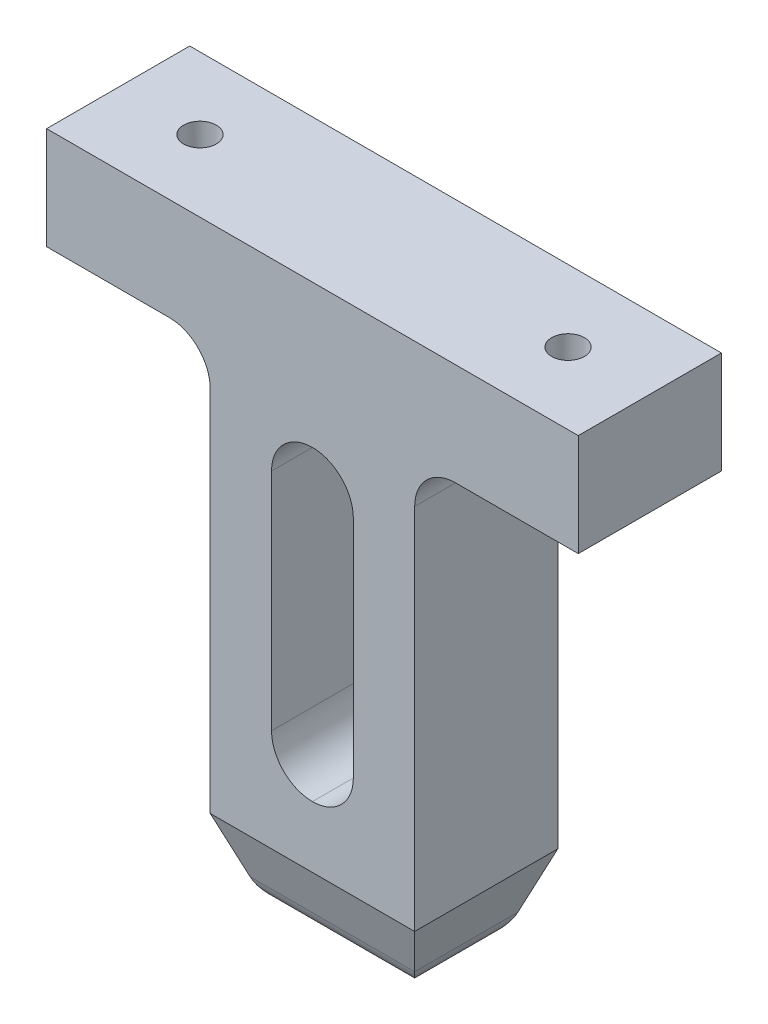
ISO-10303-21;
HEADER;
FILE_DESCRIPTION(('STEP AP214'),'2;1');
FILE_NAME('part.step','',(''),(''),'','','');
FILE_SCHEMA(('AUTOMOTIVE_DESIGN { 1 0 10303 214 1 1 1 1 }'));
ENDSEC;
DATA;
#1=APPLICATION_CONTEXT('core data for automotive mechanical design processes');
#2=APPLICATION_PROTOCOL_DEFINITION('international standard','automotive_design',2000,#1);
#3=PRODUCT_CONTEXT('',#1,'mechanical');
#4=PRODUCT('Part','Part','',(#3));
#5=PRODUCT_RELATED_PRODUCT_CATEGORY('part','',(#4));
#6=PRODUCT_DEFINITION_FORMATION('','',#4);
#7=PRODUCT_DEFINITION_CONTEXT('part definition',#1,'design');
#8=PRODUCT_DEFINITION('design','',#6,#7);
#9=PRODUCT_DEFINITION_SHAPE('','',#8);
#10=(LENGTH_UNIT() NAMED_UNIT(*) SI_UNIT(.MILLI.,.METRE.));
#11=(NAMED_UNIT(*) PLANE_ANGLE_UNIT() SI_UNIT($,.RADIAN.));
#12=(NAMED_UNIT(*) SI_UNIT($,.STERADIAN.) SOLID_ANGLE_UNIT());
#13=UNCERTAINTY_MEASURE_WITH_UNIT(LENGTH_MEASURE(1.E-05),#10,'distance_accuracy_value','');
#14=(GEOMETRIC_REPRESENTATION_CONTEXT(3) GLOBAL_UNCERTAINTY_ASSIGNED_CONTEXT((#13)) GLOBAL_UNIT_ASSIGNED_CONTEXT((#10,
#11,#12)) REPRESENTATION_CONTEXT('',''));
#15=CARTESIAN_POINT('',(0.,0.,0.));
#16=DIRECTION('',(0.,0.,1.));
#17=DIRECTION('',(1.,0.,0.));
#18=AXIS2_PLACEMENT_3D('',#15,#16,#17);
#19=CARTESIAN_POINT('',(18.,-22.5,3.5));
#20=DIRECTION('',(0.939692620785908,-0.342020143325669,0.));
#21=DIRECTION('',(0.342020143325669,0.939692620785908,0.));
#22=AXIS2_PLACEMENT_3D('',#19,#20,#21);
#23=PLANE('',#22);
#24=DIRECTION('',(0.323615577118185,0.889126490715988,0.323615577118185));
#25=VECTOR('',#24,1.);
#26=CARTESIAN_POINT('',(18.,-22.5,3.5));
#27=LINE('',#26,#25);
#28=CARTESIAN_POINT('',(17.0230892280876,-25.1840402866513,2.52308922808758));
#29=VERTEX_POINT('',#28);
#30=CARTESIAN_POINT('',(18.,-22.5,3.5));
#31=VERTEX_POINT('',#30);
#32=EDGE_CURVE('E101',#29,#31,#27,.T.);
#33=ORIENTED_EDGE('',*,*,#32,.F.);
#34=DIRECTION('',(0.,0.,1.));
#35=VECTOR('',#34,1.);
#36=CARTESIAN_POINT('',(17.0230892280876,-25.1840402866513,3.5));
#37=LINE('',#36,#35);
#38=CARTESIAN_POINT('',(17.0230892280876,-25.1840402866513,-2.52308922808759));
#39=VERTEX_POINT('',#38);
#40=EDGE_CURVE('E12',#29,#39,#37,.F.);
#41=ORIENTED_EDGE('',*,*,#40,.T.);
#42=DIRECTION('',(0.323615577118185,0.889126490715988,-0.323615577118185));
#43=VECTOR('',#42,1.);
#44=CARTESIAN_POINT('',(17.2669107077253,-24.5141462769689,-2.76691070772525));
#45=LINE('',#44,#43);
#46=CARTESIAN_POINT('',(18.,-22.5,-3.5));
#47=VERTEX_POINT('',#46);
#48=EDGE_CURVE('E121',#39,#47,#45,.T.);
#49=ORIENTED_EDGE('',*,*,#48,.T.);
#50=DIRECTION('',(0.,0.,1.));
#51=VECTOR('',#50,1.);
#52=CARTESIAN_POINT('',(18.,-22.5,3.5));
#53=LINE('',#52,#51);
#54=EDGE_CURVE('E116',#47,#31,#53,.T.);
#55=ORIENTED_EDGE('',*,*,#54,.T.);
#56=EDGE_LOOP('',(#33,#41,#49,#55));
#57=FACE_BOUND('',#56,.T.);
#58=ADVANCED_FACE('F49',(#57),#23,.T.);
#59=CARTESIAN_POINT('',(18.,-22.5,3.5));
#60=DIRECTION('',(0.,-0.342020143325669,0.939692620785908));
#61=DIRECTION('',(0.,-0.939692620785908,-0.342020143325669));
#62=AXIS2_PLACEMENT_3D('',#59,#60,#61);
#63=PLANE('',#62);
#64=DIRECTION('',(-0.323615577118185,0.889126490715988,0.323615577118185));
#65=VECTOR('',#64,1.);
#66=CARTESIAN_POINT('',(8.,-22.5,3.5));
#67=LINE('',#66,#65);
#68=CARTESIAN_POINT('',(8.97691077191242,-25.1840402866513,2.52308922808758));
#69=VERTEX_POINT('',#68);
#70=CARTESIAN_POINT('',(8.,-22.5,3.5));
#71=VERTEX_POINT('',#70);
#72=EDGE_CURVE('E110',#69,#71,#67,.T.);
#73=ORIENTED_EDGE('',*,*,#72,.F.);
#74=DIRECTION('',(-1.,0.,0.));
#75=VECTOR('',#74,1.);
#76=CARTESIAN_POINT('',(18.,-25.1840402866513,2.52308922808758));
#77=LINE('',#76,#75);
#78=EDGE_CURVE('E58',#69,#29,#77,.F.);
#79=ORIENTED_EDGE('',*,*,#78,.T.);
#80=ORIENTED_EDGE('',*,*,#32,.T.);
#81=DIRECTION('',(-1.,0.,0.));
#82=VECTOR('',#81,1.);
#83=CARTESIAN_POINT('',(18.,-22.5,3.5));
#84=LINE('',#83,#82);
#85=EDGE_CURVE('E104',#31,#71,#84,.T.);
#86=ORIENTED_EDGE('',*,*,#85,.T.);
#87=EDGE_LOOP('',(#73,#79,#80,#86));
#88=FACE_BOUND('',#87,.T.);
#89=ADVANCED_FACE('F103',(#88),#63,.T.);
#90=CARTESIAN_POINT('',(8.,-22.5,3.5));
#91=DIRECTION('',(-0.939692620785908,-0.342020143325669,0.));
#92=DIRECTION('',(0.342020143325669,-0.939692620785908,0.));
#93=AXIS2_PLACEMENT_3D('',#90,#91,#92);
#94=PLANE('',#93);
#95=DIRECTION('',(-0.323615577118185,0.889126490715988,-0.323615577118185));
#96=VECTOR('',#95,1.);
#97=CARTESIAN_POINT('',(9.04727041753537,-25.3773518242412,-2.45272958246464));
#98=LINE('',#97,#96);
#99=CARTESIAN_POINT('',(8.97691077191242,-25.1840402866513,-2.52308922808759));
#100=VERTEX_POINT('',#99);
#101=CARTESIAN_POINT('',(8.,-22.5,-3.5));
#102=VERTEX_POINT('',#101);
#103=EDGE_CURVE('E131',#100,#102,#98,.T.);
#104=ORIENTED_EDGE('',*,*,#103,.F.);
#105=DIRECTION('',(0.,0.,-1.));
#106=VECTOR('',#105,1.);
#107=CARTESIAN_POINT('',(8.97691077191242,-25.1840402866513,3.5));
#108=LINE('',#107,#106);
#109=EDGE_CURVE('E73',#100,#69,#108,.F.);
#110=ORIENTED_EDGE('',*,*,#109,.T.);
#111=ORIENTED_EDGE('',*,*,#72,.T.);
#112=DIRECTION('',(0.,0.,-1.));
#113=VECTOR('',#112,1.);
#114=CARTESIAN_POINT('',(8.,-22.5,3.5));
#115=LINE('',#114,#113);
#116=EDGE_CURVE('E118',#71,#102,#115,.T.);
#117=ORIENTED_EDGE('',*,*,#116,.T.);
#118=EDGE_LOOP('',(#104,#110,#111,#117));
#119=FACE_BOUND('',#118,.T.);
#120=ADVANCED_FACE('F169',(#119),#94,.T.);
#121=CARTESIAN_POINT('',(18.,-22.5,-3.5));
#122=DIRECTION('',(0.,-0.342020143325669,-0.939692620785908));
#123=DIRECTION('',(0.,0.939692620785908,-0.342020143325669));
#124=AXIS2_PLACEMENT_3D('',#121,#122,#123);
#125=PLANE('',#124);
#126=ORIENTED_EDGE('',*,*,#48,.F.);
#127=DIRECTION('',(1.,0.,0.));
#128=VECTOR('',#127,1.);
#129=CARTESIAN_POINT('',(18.,-25.1840402866513,-2.52308922808759));
#130=LINE('',#129,#128);
#131=EDGE_CURVE('E142',#39,#100,#130,.F.);
#132=ORIENTED_EDGE('',*,*,#131,.T.);
#133=ORIENTED_EDGE('',*,*,#103,.T.);
#134=DIRECTION('',(1.,0.,0.));
#135=VECTOR('',#134,1.);
#136=CARTESIAN_POINT('',(18.,-22.5,-3.5));
#137=LINE('',#136,#135);
#138=EDGE_CURVE('E128',#102,#47,#137,.T.);
#139=ORIENTED_EDGE('',*,*,#138,.T.);
#140=EDGE_LOOP('',(#126,#132,#133,#139));
#141=FACE_BOUND('',#140,.T.);
#142=ADVANCED_FACE('F168',(#141),#125,.T.);
#143=CARTESIAN_POINT('',(0.,-26.5,0.));
#144=DIRECTION('',(0.,1.,0.));
#145=DIRECTION('',(0.,0.,1.));
#146=AXIS2_PLACEMENT_3D('',#143,#144,#145);
#147=PLANE('',#146);
#148=DIRECTION('',(0.,0.,1.));
#149=VECTOR('',#148,1.);
#150=CARTESIAN_POINT('',(10.8562960134842,-26.5,0.));
#151=LINE('',#150,#149);
#152=CARTESIAN_POINT('',(10.8562960134842,-26.5,0.643703986515769));
#153=VERTEX_POINT('',#152);
#154=CARTESIAN_POINT('',(10.8562960134842,-26.5,-0.643703986515769));
#155=VERTEX_POINT('',#154);
#156=EDGE_CURVE('E137',#153,#155,#151,.F.);
#157=ORIENTED_EDGE('',*,*,#156,.T.);
#158=DIRECTION('',(-1.,0.,0.));
#159=VECTOR('',#158,1.);
#160=CARTESIAN_POINT('',(0.,-26.5,-0.643703986515769));
#161=LINE('',#160,#159);
#162=CARTESIAN_POINT('',(15.1437039865158,-26.5,-0.643703986515769));
#163=VERTEX_POINT('',#162);
#164=EDGE_CURVE('E139',#155,#163,#161,.F.);
#165=ORIENTED_EDGE('',*,*,#164,.T.);
#166=DIRECTION('',(0.,0.,-1.));
#167=VECTOR('',#166,1.);
#168=CARTESIAN_POINT('',(15.1437039865158,-26.5,0.));
#169=LINE('',#168,#167);
#170=CARTESIAN_POINT('',(15.1437039865158,-26.5,0.643703986515769));
#171=VERTEX_POINT('',#170);
#172=EDGE_CURVE('E109',#163,#171,#169,.F.);
#173=ORIENTED_EDGE('',*,*,#172,.T.);
#174=DIRECTION('',(1.,0.,0.));
#175=VECTOR('',#174,1.);
#176=CARTESIAN_POINT('',(0.,-26.5,0.643703986515769));
#177=LINE('',#176,#175);
#178=EDGE_CURVE('E135',#171,#153,#177,.F.);
#179=ORIENTED_EDGE('',*,*,#178,.T.);
#180=EDGE_LOOP('',(#157,#165,#173,#179));
#181=FACE_BOUND('',#180,.T.);
#182=ADVANCED_FACE('F161',(#181),#147,.F.);
#183=CARTESIAN_POINT('',(0.,-22.5,0.));
#184=DIRECTION('',(0.,1.,0.));
#185=DIRECTION('',(0.,0.,1.));
#186=AXIS2_PLACEMENT_3D('',#183,#184,#185);
#187=PLANE('',#186);
#188=ORIENTED_EDGE('',*,*,#54,.F.);
#189=ORIENTED_EDGE('',*,*,#138,.F.);
#190=ORIENTED_EDGE('',*,*,#116,.F.);
#191=ORIENTED_EDGE('',*,*,#85,.F.);
#192=EDGE_LOOP('',(#188,#189,#190,#191));
#193=FACE_BOUND('',#192,.T.);
#194=ADVANCED_FACE('F114',(#193),#187,.T.);
#195=CARTESIAN_POINT('',(0.,-24.5,0.643703986515769));
#196=DIRECTION('',(1.,0.,0.));
#197=DIRECTION('',(0.,0.,-1.));
#198=AXIS2_PLACEMENT_3D('',#195,#196,#197);
#199=CYLINDRICAL_SURFACE('',#198,2.);
#200=CARTESIAN_POINT('',(15.1437039865158,-24.5,0.643703986515769));
#201=DIRECTION('',(0.707106781186548,0.,-0.707106781186547));
#202=DIRECTION('',(-0.707106781186548,0.,-0.707106781186547));
#203=AXIS2_PLACEMENT_3D('',#200,#201,#202);
#204=ELLIPSE('',#203,2.82842712474619,2.);
#205=EDGE_CURVE('E125',#29,#171,#204,.T.);
#206=ORIENTED_EDGE('',*,*,#205,.F.);
#207=ORIENTED_EDGE('',*,*,#78,.F.);
#208=CARTESIAN_POINT('',(10.8562960134842,-24.5,0.643703986515769));
#209=DIRECTION('',(0.707106781186548,0.,0.707106781186547));
#210=DIRECTION('',(0.707106781186548,0.,-0.707106781186547));
#211=AXIS2_PLACEMENT_3D('',#208,#209,#210);
#212=ELLIPSE('',#211,2.82842712474619,2.);
#213=EDGE_CURVE('E53',#153,#69,#212,.F.);
#214=ORIENTED_EDGE('',*,*,#213,.F.);
#215=ORIENTED_EDGE('',*,*,#178,.F.);
#216=EDGE_LOOP('',(#206,#207,#214,#215));
#217=FACE_BOUND('',#216,.T.);
#218=ADVANCED_FACE('F51',(#217),#199,.T.);
#219=CARTESIAN_POINT('',(10.8562960134842,-24.5,0.));
#220=DIRECTION('',(0.,0.,1.));
#221=DIRECTION('',(1.,0.,0.));
#222=AXIS2_PLACEMENT_3D('',#219,#220,#221);
#223=CYLINDRICAL_SURFACE('',#222,2.);
#224=ORIENTED_EDGE('',*,*,#213,.T.);
#225=ORIENTED_EDGE('',*,*,#109,.F.);
#226=CARTESIAN_POINT('',(10.8562960134842,-24.5,-0.643703986515769));
#227=DIRECTION('',(-0.707106781186548,0.,0.707106781186547));
#228=DIRECTION('',(0.707106781186548,0.,0.707106781186547));
#229=AXIS2_PLACEMENT_3D('',#226,#227,#228);
#230=ELLIPSE('',#229,2.82842712474619,2.);
#231=EDGE_CURVE('E149',#155,#100,#230,.F.);
#232=ORIENTED_EDGE('',*,*,#231,.F.);
#233=ORIENTED_EDGE('',*,*,#156,.F.);
#234=EDGE_LOOP('',(#224,#225,#232,#233));
#235=FACE_BOUND('',#234,.T.);
#236=ADVANCED_FACE('F200',(#235),#223,.T.);
#237=CARTESIAN_POINT('',(15.1437039865158,-24.5,0.));
#238=DIRECTION('',(0.,0.,-1.));
#239=DIRECTION('',(-1.,0.,0.));
#240=AXIS2_PLACEMENT_3D('',#237,#238,#239);
#241=CYLINDRICAL_SURFACE('',#240,2.);
#242=ORIENTED_EDGE('',*,*,#205,.T.);
#243=ORIENTED_EDGE('',*,*,#172,.F.);
#244=CARTESIAN_POINT('',(15.1437039865158,-24.5,-0.643703986515769));
#245=DIRECTION('',(-0.707106781186548,0.,-0.707106781186547));
#246=DIRECTION('',(0.707106781186548,0.,-0.707106781186547));
#247=AXIS2_PLACEMENT_3D('',#244,#245,#246);
#248=ELLIPSE('',#247,2.82842712474619,2.);
#249=EDGE_CURVE('E147',#39,#163,#248,.T.);
#250=ORIENTED_EDGE('',*,*,#249,.F.);
#251=ORIENTED_EDGE('',*,*,#40,.F.);
#252=EDGE_LOOP('',(#242,#243,#250,#251));
#253=FACE_BOUND('',#252,.T.);
#254=ADVANCED_FACE('F154',(#253),#241,.T.);
#255=CARTESIAN_POINT('',(0.,-24.5,-0.643703986515769));
#256=DIRECTION('',(-1.,0.,0.));
#257=DIRECTION('',(0.,0.,1.));
#258=AXIS2_PLACEMENT_3D('',#255,#256,#257);
#259=CYLINDRICAL_SURFACE('',#258,2.);
#260=ORIENTED_EDGE('',*,*,#231,.T.);
#261=ORIENTED_EDGE('',*,*,#131,.F.);
#262=ORIENTED_EDGE('',*,*,#249,.T.);
#263=ORIENTED_EDGE('',*,*,#164,.F.);
#264=EDGE_LOOP('',(#260,#261,#262,#263));
#265=FACE_BOUND('',#264,.T.);
#266=ADVANCED_FACE('F165',(#265),#259,.T.);
#267=CLOSED_SHELL('',(#58,#89,#120,#142,#182,#194,#218,#236,#254,#266));
#268=MANIFOLD_SOLID_BREP('B2',#267);
#269=CARTESIAN_POINT('',(26.,-2.5,3.5));
#270=DIRECTION('',(0.,1.,0.));
#271=DIRECTION('',(0.,0.,1.));
#272=AXIS2_PLACEMENT_3D('',#269,#270,#271);
#273=PLANE('',#272);
#274=CARTESIAN_POINT('',(3.99999999999999,-2.5,0.));
#275=DIRECTION('',(0.,1.,0.));
#276=DIRECTION('',(0.,0.,1.));
#277=AXIS2_PLACEMENT_3D('',#274,#275,#276);
#278=CIRCLE('',#277,0.799999999987501);
#279=CARTESIAN_POINT('',(3.99999999999999,-2.5,0.799999999987501));
#280=VERTEX_POINT('',#279);
#281=EDGE_CURVE('E414',#280,#280,#278,.F.);
#282=ORIENTED_EDGE('',*,*,#281,.F.);
#283=EDGE_LOOP('',(#282));
#284=FACE_BOUND('',#283,.T.);
#285=DIRECTION('',(-1.,0.,0.));
#286=VECTOR('',#285,1.);
#287=CARTESIAN_POINT('',(26.,-2.5,-3.5));
#288=LINE('',#287,#286);
#289=CARTESIAN_POINT('',(6.00000000000001,-2.5,-3.5));
#290=VERTEX_POINT('',#289);
#291=CARTESIAN_POINT('',(0.,-2.5,-3.5));
#292=VERTEX_POINT('',#291);
#293=EDGE_CURVE('E410',#290,#292,#288,.T.);
#294=ORIENTED_EDGE('',*,*,#293,.F.);
#295=DIRECTION('',(0.,0.,-1.));
#296=VECTOR('',#295,1.);
#297=CARTESIAN_POINT('',(6.,-2.5,3.5));
#298=LINE('',#297,#296);
#299=CARTESIAN_POINT('',(6.00000000000001,-2.5,3.5));
#300=VERTEX_POINT('',#299);
#301=EDGE_CURVE('E274',#290,#300,#298,.F.);
#302=ORIENTED_EDGE('',*,*,#301,.T.);
#303=DIRECTION('',(-1.,0.,0.));
#304=VECTOR('',#303,1.);
#305=CARTESIAN_POINT('',(26.,-2.5,3.5));
#306=LINE('',#305,#304);
#307=CARTESIAN_POINT('',(0.,-2.5,3.5));
#308=VERTEX_POINT('',#307);
#309=EDGE_CURVE('E424',#300,#308,#306,.T.);
#310=ORIENTED_EDGE('',*,*,#309,.T.);
#311=DIRECTION('',(0.,0.,-1.));
#312=VECTOR('',#311,1.);
#313=CARTESIAN_POINT('',(0.,-2.5,3.5));
#314=LINE('',#313,#312);
#315=EDGE_CURVE('E404',#308,#292,#314,.T.);
#316=ORIENTED_EDGE('',*,*,#315,.T.);
#317=EDGE_LOOP('',(#294,#302,#310,#316));
#318=FACE_BOUND('',#317,.T.);
#319=ADVANCED_FACE('F253',(#284,#318),#273,.F.);
#320=CARTESIAN_POINT('',(22.,-2.5,0.));
#321=DIRECTION('',(0.,1.,0.));
#322=DIRECTION('',(0.,0.,1.));
#323=AXIS2_PLACEMENT_3D('',#320,#321,#322);
#324=CIRCLE('',#323,0.799999999987508);
#325=CARTESIAN_POINT('',(22.,-2.5,0.799999999987512));
#326=VERTEX_POINT('',#325);
#327=EDGE_CURVE('E398',#326,#326,#324,.F.);
#328=ORIENTED_EDGE('',*,*,#327,.F.);
#329=EDGE_LOOP('',(#328));
#330=FACE_BOUND('',#329,.T.);
#331=CARTESIAN_POINT('',(26.,-2.5,3.5));
#332=VERTEX_POINT('',#331);
#333=CARTESIAN_POINT('',(20.,-2.5,3.5));
#334=VERTEX_POINT('',#333);
#335=EDGE_CURVE('E425',#332,#334,#306,.T.);
#336=ORIENTED_EDGE('',*,*,#335,.T.);
#337=DIRECTION('',(0.,0.,1.));
#338=VECTOR('',#337,1.);
#339=CARTESIAN_POINT('',(20.,-2.5,-3.5));
#340=LINE('',#339,#338);
#341=CARTESIAN_POINT('',(20.,-2.5,-3.5));
#342=VERTEX_POINT('',#341);
#343=EDGE_CURVE('E474',#334,#342,#340,.F.);
#344=ORIENTED_EDGE('',*,*,#343,.T.);
#345=CARTESIAN_POINT('',(26.,-2.5,-3.5));
#346=VERTEX_POINT('',#345);
#347=EDGE_CURVE('E421',#346,#342,#288,.T.);
#348=ORIENTED_EDGE('',*,*,#347,.F.);
#349=DIRECTION('',(0.,0.,-1.));
#350=VECTOR('',#349,1.);
#351=CARTESIAN_POINT('',(26.,-2.5,3.5));
#352=LINE('',#351,#350);
#353=EDGE_CURVE('E408',#332,#346,#352,.T.);
#354=ORIENTED_EDGE('',*,*,#353,.F.);
#355=EDGE_LOOP('',(#336,#344,#348,#354));
#356=FACE_BOUND('',#355,.T.);
#357=ADVANCED_FACE('F498',(#330,#356),#273,.F.);
#358=CARTESIAN_POINT('',(26.,2.5,-3.5));
#359=DIRECTION('',(0.,0.,1.));
#360=DIRECTION('',(1.,0.,0.));
#361=AXIS2_PLACEMENT_3D('',#358,#359,#360);
#362=PLANE('',#361);
#363=CARTESIAN_POINT('',(13.,-6.5,-3.5));
#364=DIRECTION('',(0.,0.,1.));
#365=DIRECTION('',(1.,0.,0.));
#366=AXIS2_PLACEMENT_3D('',#363,#364,#365);
#367=CIRCLE('',#366,2.);
#368=CARTESIAN_POINT('',(15.,-6.5,-3.5));
#369=VERTEX_POINT('',#368);
#370=CARTESIAN_POINT('',(13.,-4.5,-3.5));
#371=VERTEX_POINT('',#370);
#372=EDGE_CURVE('E450',#369,#371,#367,.T.);
#373=ORIENTED_EDGE('',*,*,#372,.T.);
#374=CARTESIAN_POINT('',(13.,-6.5,-3.5));
#375=DIRECTION('',(0.,0.,1.));
#376=DIRECTION('',(1.,0.,0.));
#377=AXIS2_PLACEMENT_3D('',#374,#375,#376);
#378=CIRCLE('',#377,2.);
#379=CARTESIAN_POINT('',(11.,-6.5,-3.5));
#380=VERTEX_POINT('',#379);
#381=EDGE_CURVE('E454',#371,#380,#378,.T.);
#382=ORIENTED_EDGE('',*,*,#381,.T.);
#383=DIRECTION('',(0.,-1.,0.));
#384=VECTOR('',#383,1.);
#385=CARTESIAN_POINT('',(11.,2.5,-3.5));
#386=LINE('',#385,#384);
#387=CARTESIAN_POINT('',(11.,-17.5,-3.5));
#388=VERTEX_POINT('',#387);
#389=EDGE_CURVE('E382',#380,#388,#386,.T.);
#390=ORIENTED_EDGE('',*,*,#389,.T.);
#391=CARTESIAN_POINT('',(13.,-17.5,-3.5));
#392=DIRECTION('',(0.,0.,1.));
#393=DIRECTION('',(1.,0.,0.));
#394=AXIS2_PLACEMENT_3D('',#391,#392,#393);
#395=CIRCLE('',#394,2.);
#396=CARTESIAN_POINT('',(13.,-19.5,-3.5));
#397=VERTEX_POINT('',#396);
#398=EDGE_CURVE('E462',#388,#397,#395,.T.);
#399=ORIENTED_EDGE('',*,*,#398,.T.);
#400=CARTESIAN_POINT('',(13.,-17.5,-3.5));
#401=DIRECTION('',(0.,0.,1.));
#402=DIRECTION('',(1.,0.,0.));
#403=AXIS2_PLACEMENT_3D('',#400,#401,#402);
#404=CIRCLE('',#403,2.);
#405=CARTESIAN_POINT('',(15.,-17.5,-3.5));
#406=VERTEX_POINT('',#405);
#407=EDGE_CURVE('E458',#397,#406,#404,.T.);
#408=ORIENTED_EDGE('',*,*,#407,.T.);
#409=DIRECTION('',(0.,1.,0.));
#410=VECTOR('',#409,1.);
#411=CARTESIAN_POINT('',(15.,2.5,-3.5));
#412=LINE('',#411,#410);
#413=EDGE_CURVE('E562',#406,#369,#412,.T.);
#414=ORIENTED_EDGE('',*,*,#413,.T.);
#415=EDGE_LOOP('',(#373,#382,#390,#399,#408,#414));
#416=FACE_BOUND('',#415,.T.);
#417=DIRECTION('',(0.,1.,0.));
#418=VECTOR('',#417,1.);
#419=CARTESIAN_POINT('',(0.,2.5,-3.5));
#420=LINE('',#419,#418);
#421=CARTESIAN_POINT('',(0.,2.5,-3.5));
#422=VERTEX_POINT('',#421);
#423=EDGE_CURVE('E411',#292,#422,#420,.T.);
#424=ORIENTED_EDGE('',*,*,#423,.T.);
#425=DIRECTION('',(-1.,0.,0.));
#426=VECTOR('',#425,1.);
#427=CARTESIAN_POINT('',(26.,2.5,-3.5));
#428=LINE('',#427,#426);
#429=CARTESIAN_POINT('',(26.,2.5,-3.5));
#430=VERTEX_POINT('',#429);
#431=EDGE_CURVE('E431',#430,#422,#428,.T.);
#432=ORIENTED_EDGE('',*,*,#431,.F.);
#433=DIRECTION('',(0.,1.,0.));
#434=VECTOR('',#433,1.);
#435=CARTESIAN_POINT('',(26.,2.5,-3.5));
#436=LINE('',#435,#434);
#437=EDGE_CURVE('E400',#346,#430,#436,.T.);
#438=ORIENTED_EDGE('',*,*,#437,.F.);
#439=ORIENTED_EDGE('',*,*,#347,.T.);
#440=CARTESIAN_POINT('',(20.,-4.5,-3.5));
#441=DIRECTION('',(0.,0.,1.));
#442=DIRECTION('',(1.,0.,0.));
#443=AXIS2_PLACEMENT_3D('',#440,#441,#442);
#444=CIRCLE('',#443,2.);
#445=CARTESIAN_POINT('',(18.,-4.5,-3.5));
#446=VERTEX_POINT('',#445);
#447=EDGE_CURVE('E480',#342,#446,#444,.T.);
#448=ORIENTED_EDGE('',*,*,#447,.T.);
#449=DIRECTION('',(0.,1.,0.));
#450=VECTOR('',#449,1.);
#451=CARTESIAN_POINT('',(18.,-22.5,-3.5));
#452=LINE('',#451,#450);
#453=CARTESIAN_POINT('',(18.,-22.5,-3.5));
#454=VERTEX_POINT('',#453);
#455=EDGE_CURVE('E369',#454,#446,#452,.T.);
#456=ORIENTED_EDGE('',*,*,#455,.F.);
#457=DIRECTION('',(1.,0.,0.));
#458=VECTOR('',#457,1.);
#459=CARTESIAN_POINT('',(18.,-22.5,-3.5));
#460=LINE('',#459,#458);
#461=CARTESIAN_POINT('',(8.,-22.5,-3.5));
#462=VERTEX_POINT('',#461);
#463=EDGE_CURVE('E362',#462,#454,#460,.T.);
#464=ORIENTED_EDGE('',*,*,#463,.F.);
#465=DIRECTION('',(0.,1.,0.));
#466=VECTOR('',#465,1.);
#467=CARTESIAN_POINT('',(8.,-22.5,-3.5));
#468=LINE('',#467,#466);
#469=CARTESIAN_POINT('',(8.,-4.5,-3.5));
#470=VERTEX_POINT('',#469);
#471=EDGE_CURVE('E367',#462,#470,#468,.T.);
#472=ORIENTED_EDGE('',*,*,#471,.T.);
#473=CARTESIAN_POINT('',(6.,-4.5,-3.5));
#474=DIRECTION('',(0.,0.,1.));
#475=DIRECTION('',(1.,0.,0.));
#476=AXIS2_PLACEMENT_3D('',#473,#474,#475);
#477=CIRCLE('',#476,2.);
#478=EDGE_CURVE('E261',#470,#290,#477,.T.);
#479=ORIENTED_EDGE('',*,*,#478,.T.);
#480=ORIENTED_EDGE('',*,*,#293,.T.);
#481=EDGE_LOOP('',(#424,#432,#438,#439,#448,#456,#464,#472,#479,#480));
#482=FACE_BOUND('',#481,.T.);
#483=ADVANCED_FACE('F365',(#416,#482),#362,.F.);
#484=CARTESIAN_POINT('',(26.,2.5,3.5));
#485=DIRECTION('',(0.,-1.,0.));
#486=DIRECTION('',(0.,0.,-1.));
#487=AXIS2_PLACEMENT_3D('',#484,#485,#486);
#488=PLANE('',#487);
#489=CARTESIAN_POINT('',(3.99999999999999,2.5,0.));
#490=DIRECTION('',(0.,-1.,0.));
#491=DIRECTION('',(0.,0.,-1.));
#492=AXIS2_PLACEMENT_3D('',#489,#490,#491);
#493=CIRCLE('',#492,0.799999999987501);
#494=CARTESIAN_POINT('',(3.99999999999999,2.5,-0.799999999987501));
#495=VERTEX_POINT('',#494);
#496=EDGE_CURVE('E391',#495,#495,#493,.T.);
#497=ORIENTED_EDGE('',*,*,#496,.T.);
#498=EDGE_LOOP('',(#497));
#499=FACE_BOUND('',#498,.T.);
#500=CARTESIAN_POINT('',(22.,2.5,0.));
#501=DIRECTION('',(0.,-1.,0.));
#502=DIRECTION('',(0.,0.,-1.));
#503=AXIS2_PLACEMENT_3D('',#500,#501,#502);
#504=CIRCLE('',#503,0.799999999987508);
#505=CARTESIAN_POINT('',(22.,2.5,-0.799999999987505));
#506=VERTEX_POINT('',#505);
#507=EDGE_CURVE('E388',#506,#506,#504,.T.);
#508=ORIENTED_EDGE('',*,*,#507,.T.);
#509=EDGE_LOOP('',(#508));
#510=FACE_BOUND('',#509,.T.);
#511=DIRECTION('',(0.,0.,1.));
#512=VECTOR('',#511,1.);
#513=CARTESIAN_POINT('',(0.,2.5,3.5));
#514=LINE('',#513,#512);
#515=CARTESIAN_POINT('',(0.,2.5,3.5));
#516=VERTEX_POINT('',#515);
#517=EDGE_CURVE('E413',#422,#516,#514,.T.);
#518=ORIENTED_EDGE('',*,*,#517,.T.);
#519=DIRECTION('',(-1.,0.,0.));
#520=VECTOR('',#519,1.);
#521=CARTESIAN_POINT('',(26.,2.5,3.5));
#522=LINE('',#521,#520);
#523=CARTESIAN_POINT('',(26.,2.5,3.5));
#524=VERTEX_POINT('',#523);
#525=EDGE_CURVE('E428',#524,#516,#522,.T.);
#526=ORIENTED_EDGE('',*,*,#525,.F.);
#527=DIRECTION('',(0.,0.,1.));
#528=VECTOR('',#527,1.);
#529=CARTESIAN_POINT('',(26.,2.5,3.5));
#530=LINE('',#529,#528);
#531=EDGE_CURVE('E403',#430,#524,#530,.T.);
#532=ORIENTED_EDGE('',*,*,#531,.F.);
#533=ORIENTED_EDGE('',*,*,#431,.T.);
#534=EDGE_LOOP('',(#518,#526,#532,#533));
#535=FACE_BOUND('',#534,.T.);
#536=ADVANCED_FACE('F529',(#499,#510,#535),#488,.F.);
#537=CARTESIAN_POINT('',(26.,2.5,3.5));
#538=DIRECTION('',(0.,0.,-1.));
#539=DIRECTION('',(0.,1.,0.));
#540=AXIS2_PLACEMENT_3D('',#537,#538,#539);
#541=PLANE('',#540);
#542=CARTESIAN_POINT('',(13.,-17.5,3.5));
#543=DIRECTION('',(0.,0.,-1.));
#544=DIRECTION('',(0.,1.,0.));
#545=AXIS2_PLACEMENT_3D('',#542,#543,#544);
#546=CIRCLE('',#545,2.);
#547=CARTESIAN_POINT('',(15.,-17.5,3.5));
#548=VERTEX_POINT('',#547);
#549=CARTESIAN_POINT('',(13.,-19.5,3.5));
#550=VERTEX_POINT('',#549);
#551=EDGE_CURVE('E456',#548,#550,#546,.T.);
#552=ORIENTED_EDGE('',*,*,#551,.T.);
#553=CARTESIAN_POINT('',(13.,-17.5,3.5));
#554=DIRECTION('',(0.,0.,-1.));
#555=DIRECTION('',(0.,1.,0.));
#556=AXIS2_PLACEMENT_3D('',#553,#554,#555);
#557=CIRCLE('',#556,2.);
#558=CARTESIAN_POINT('',(11.,-17.5,3.5));
#559=VERTEX_POINT('',#558);
#560=EDGE_CURVE('E460',#550,#559,#557,.T.);
#561=ORIENTED_EDGE('',*,*,#560,.T.);
#562=DIRECTION('',(0.,-1.,0.));
#563=VECTOR('',#562,1.);
#564=CARTESIAN_POINT('',(11.,-4.5,3.5));
#565=LINE('',#564,#563);
#566=CARTESIAN_POINT('',(11.,-6.5,3.5));
#567=VERTEX_POINT('',#566);
#568=EDGE_CURVE('E468',#567,#559,#565,.T.);
#569=ORIENTED_EDGE('',*,*,#568,.F.);
#570=CARTESIAN_POINT('',(13.,-6.5,3.5));
#571=DIRECTION('',(0.,0.,-1.));
#572=DIRECTION('',(0.,1.,0.));
#573=AXIS2_PLACEMENT_3D('',#570,#571,#572);
#574=CIRCLE('',#573,2.);
#575=CARTESIAN_POINT('',(13.,-4.5,3.5));
#576=VERTEX_POINT('',#575);
#577=EDGE_CURVE('E452',#567,#576,#574,.T.);
#578=ORIENTED_EDGE('',*,*,#577,.T.);
#579=CARTESIAN_POINT('',(13.,-6.5,3.5));
#580=DIRECTION('',(0.,0.,-1.));
#581=DIRECTION('',(0.,1.,0.));
#582=AXIS2_PLACEMENT_3D('',#579,#580,#581);
#583=CIRCLE('',#582,2.);
#584=CARTESIAN_POINT('',(15.,-6.5,3.5));
#585=VERTEX_POINT('',#584);
#586=EDGE_CURVE('E448',#576,#585,#583,.T.);
#587=ORIENTED_EDGE('',*,*,#586,.T.);
#588=DIRECTION('',(0.,1.,0.));
#589=VECTOR('',#588,1.);
#590=CARTESIAN_POINT('',(15.,-4.5,3.5));
#591=LINE('',#590,#589);
#592=EDGE_CURVE('E568',#548,#585,#591,.T.);
#593=ORIENTED_EDGE('',*,*,#592,.F.);
#594=EDGE_LOOP('',(#552,#561,#569,#578,#587,#593));
#595=FACE_BOUND('',#594,.T.);
#596=DIRECTION('',(0.,-1.,0.));
#597=VECTOR('',#596,1.);
#598=CARTESIAN_POINT('',(0.,2.5,3.5));
#599=LINE('',#598,#597);
#600=EDGE_CURVE('E416',#516,#308,#599,.T.);
#601=ORIENTED_EDGE('',*,*,#600,.T.);
#602=ORIENTED_EDGE('',*,*,#309,.F.);
#603=CARTESIAN_POINT('',(6.,-4.5,3.5));
#604=DIRECTION('',(0.,0.,-1.));
#605=DIRECTION('',(0.,1.,0.));
#606=AXIS2_PLACEMENT_3D('',#603,#604,#605);
#607=CIRCLE('',#606,2.);
#608=CARTESIAN_POINT('',(8.,-4.5,3.5));
#609=VERTEX_POINT('',#608);
#610=EDGE_CURVE('E47',#300,#609,#607,.T.);
#611=ORIENTED_EDGE('',*,*,#610,.T.);
#612=DIRECTION('',(0.,1.,0.));
#613=VECTOR('',#612,1.);
#614=CARTESIAN_POINT('',(8.,-22.5,3.5));
#615=LINE('',#614,#613);
#616=CARTESIAN_POINT('',(8.,-22.5,3.5));
#617=VERTEX_POINT('',#616);
#618=EDGE_CURVE('E576',#617,#609,#615,.T.);
#619=ORIENTED_EDGE('',*,*,#618,.F.);
#620=DIRECTION('',(-1.,0.,0.));
#621=VECTOR('',#620,1.);
#622=CARTESIAN_POINT('',(18.,-22.5,3.5));
#623=LINE('',#622,#621);
#624=CARTESIAN_POINT('',(18.,-22.5,3.5));
#625=VERTEX_POINT('',#624);
#626=EDGE_CURVE('E378',#625,#617,#623,.T.);
#627=ORIENTED_EDGE('',*,*,#626,.F.);
#628=DIRECTION('',(0.,1.,0.));
#629=VECTOR('',#628,1.);
#630=CARTESIAN_POINT('',(18.,-22.5,3.5));
#631=LINE('',#630,#629);
#632=CARTESIAN_POINT('',(18.,-4.5,3.5));
#633=VERTEX_POINT('',#632);
#634=EDGE_CURVE('E393',#625,#633,#631,.T.);
#635=ORIENTED_EDGE('',*,*,#634,.T.);
#636=CARTESIAN_POINT('',(20.,-4.5,3.5));
#637=DIRECTION('',(0.,0.,-1.));
#638=DIRECTION('',(0.,1.,0.));
#639=AXIS2_PLACEMENT_3D('',#636,#637,#638);
#640=CIRCLE('',#639,2.);
#641=EDGE_CURVE('E478',#633,#334,#640,.T.);
#642=ORIENTED_EDGE('',*,*,#641,.T.);
#643=ORIENTED_EDGE('',*,*,#335,.F.);
#644=DIRECTION('',(0.,-1.,0.));
#645=VECTOR('',#644,1.);
#646=CARTESIAN_POINT('',(26.,2.5,3.5));
#647=LINE('',#646,#645);
#648=EDGE_CURVE('E406',#524,#332,#647,.T.);
#649=ORIENTED_EDGE('',*,*,#648,.F.);
#650=ORIENTED_EDGE('',*,*,#525,.T.);
#651=EDGE_LOOP('',(#601,#602,#611,#619,#627,#635,#642,#643,#649,#650));
#652=FACE_BOUND('',#651,.T.);
#653=ADVANCED_FACE('F494',(#595,#652),#541,.F.);
#654=CARTESIAN_POINT('',(26.,0.,0.));
#655=DIRECTION('',(1.,0.,0.));
#656=DIRECTION('',(0.,0.,-1.));
#657=AXIS2_PLACEMENT_3D('',#654,#655,#656);
#658=PLANE('',#657);
#659=ORIENTED_EDGE('',*,*,#437,.T.);
#660=ORIENTED_EDGE('',*,*,#531,.T.);
#661=ORIENTED_EDGE('',*,*,#648,.T.);
#662=ORIENTED_EDGE('',*,*,#353,.T.);
#663=EDGE_LOOP('',(#659,#660,#661,#662));
#664=FACE_BOUND('',#663,.T.);
#665=ADVANCED_FACE('F500',(#664),#658,.T.);
#666=CARTESIAN_POINT('',(0.,0.,0.));
#667=DIRECTION('',(1.,0.,0.));
#668=DIRECTION('',(0.,0.,-1.));
#669=AXIS2_PLACEMENT_3D('',#666,#667,#668);
#670=PLANE('',#669);
#671=ORIENTED_EDGE('',*,*,#423,.F.);
#672=ORIENTED_EDGE('',*,*,#315,.F.);
#673=ORIENTED_EDGE('',*,*,#600,.F.);
#674=ORIENTED_EDGE('',*,*,#517,.F.);
#675=EDGE_LOOP('',(#671,#672,#673,#674));
#676=FACE_BOUND('',#675,.T.);
#677=ADVANCED_FACE('F508',(#676),#670,.F.);
#678=CARTESIAN_POINT('',(22.,-4.5,0.));
#679=DIRECTION('',(0.,1.,0.));
#680=DIRECTION('',(0.,0.,1.));
#681=AXIS2_PLACEMENT_3D('',#678,#679,#680);
#682=CYLINDRICAL_SURFACE('',#681,0.799999999987508);
#683=ORIENTED_EDGE('',*,*,#507,.F.);
#684=EDGE_LOOP('',(#683));
#685=FACE_BOUND('',#684,.T.);
#686=ORIENTED_EDGE('',*,*,#327,.T.);
#687=EDGE_LOOP('',(#686));
#688=FACE_BOUND('',#687,.T.);
#689=ADVANCED_FACE('F603',(#685,#688),#682,.F.);
#690=CARTESIAN_POINT('',(3.99999999999999,-4.5,0.));
#691=DIRECTION('',(0.,1.,0.));
#692=DIRECTION('',(0.,0.,1.));
#693=AXIS2_PLACEMENT_3D('',#690,#691,#692);
#694=CYLINDRICAL_SURFACE('',#693,0.799999999987501);
#695=ORIENTED_EDGE('',*,*,#496,.F.);
#696=EDGE_LOOP('',(#695));
#697=FACE_BOUND('',#696,.T.);
#698=ORIENTED_EDGE('',*,*,#281,.T.);
#699=EDGE_LOOP('',(#698));
#700=FACE_BOUND('',#699,.T.);
#701=ADVANCED_FACE('F600',(#697,#700),#694,.F.);
#702=CARTESIAN_POINT('',(8.,-22.5,3.5));
#703=DIRECTION('',(1.,0.,0.));
#704=DIRECTION('',(0.,0.,-1.));
#705=AXIS2_PLACEMENT_3D('',#702,#703,#704);
#706=PLANE('',#705);
#707=ORIENTED_EDGE('',*,*,#618,.T.);
#708=DIRECTION('',(0.,0.,-1.));
#709=VECTOR('',#708,1.);
#710=CARTESIAN_POINT('',(8.,-4.5,-3.5));
#711=LINE('',#710,#709);
#712=EDGE_CURVE('E387',#609,#470,#711,.T.);
#713=ORIENTED_EDGE('',*,*,#712,.T.);
#714=ORIENTED_EDGE('',*,*,#471,.F.);
#715=DIRECTION('',(0.,0.,-1.));
#716=VECTOR('',#715,1.);
#717=CARTESIAN_POINT('',(8.,-22.5,3.5));
#718=LINE('',#717,#716);
#719=EDGE_CURVE('E373',#617,#462,#718,.T.);
#720=ORIENTED_EDGE('',*,*,#719,.F.);
#721=EDGE_LOOP('',(#707,#713,#714,#720));
#722=FACE_BOUND('',#721,.T.);
#723=ADVANCED_FACE('F385',(#722),#706,.F.);
#724=CARTESIAN_POINT('',(18.,-22.5,3.5));
#725=DIRECTION('',(-1.,0.,0.));
#726=DIRECTION('',(0.,0.,1.));
#727=AXIS2_PLACEMENT_3D('',#724,#725,#726);
#728=PLANE('',#727);
#729=ORIENTED_EDGE('',*,*,#455,.T.);
#730=DIRECTION('',(0.,0.,1.));
#731=VECTOR('',#730,1.);
#732=CARTESIAN_POINT('',(18.,-4.5,3.5));
#733=LINE('',#732,#731);
#734=EDGE_CURVE('E464',#446,#633,#733,.T.);
#735=ORIENTED_EDGE('',*,*,#734,.T.);
#736=ORIENTED_EDGE('',*,*,#634,.F.);
#737=DIRECTION('',(0.,0.,1.));
#738=VECTOR('',#737,1.);
#739=CARTESIAN_POINT('',(18.,-22.5,3.5));
#740=LINE('',#739,#738);
#741=EDGE_CURVE('E372',#454,#625,#740,.T.);
#742=ORIENTED_EDGE('',*,*,#741,.F.);
#743=EDGE_LOOP('',(#729,#735,#736,#742));
#744=FACE_BOUND('',#743,.T.);
#745=ADVANCED_FACE('F488',(#744),#728,.F.);
#746=CARTESIAN_POINT('',(0.,-22.5,0.));
#747=DIRECTION('',(0.,1.,0.));
#748=DIRECTION('',(0.,0.,1.));
#749=AXIS2_PLACEMENT_3D('',#746,#747,#748);
#750=PLANE('',#749);
#751=ORIENTED_EDGE('',*,*,#719,.T.);
#752=ORIENTED_EDGE('',*,*,#463,.T.);
#753=ORIENTED_EDGE('',*,*,#741,.T.);
#754=ORIENTED_EDGE('',*,*,#626,.T.);
#755=EDGE_LOOP('',(#751,#752,#753,#754));
#756=FACE_BOUND('',#755,.T.);
#757=ADVANCED_FACE('F376',(#756),#750,.F.);
#758=CARTESIAN_POINT('',(11.,-4.5,-16.5));
#759=DIRECTION('',(-1.,0.,0.));
#760=DIRECTION('',(0.,-1.,0.));
#761=AXIS2_PLACEMENT_3D('',#758,#759,#760);
#762=PLANE('',#761);
#763=ORIENTED_EDGE('',*,*,#389,.F.);
#764=DIRECTION('',(0.,0.,1.));
#765=VECTOR('',#764,1.);
#766=CARTESIAN_POINT('',(11.,-6.5,3.5));
#767=LINE('',#766,#765);
#768=EDGE_CURVE('E446',#380,#567,#767,.T.);
#769=ORIENTED_EDGE('',*,*,#768,.T.);
#770=ORIENTED_EDGE('',*,*,#568,.T.);
#771=DIRECTION('',(0.,0.,1.));
#772=VECTOR('',#771,1.);
#773=CARTESIAN_POINT('',(11.,-17.5,-3.5));
#774=LINE('',#773,#772);
#775=EDGE_CURVE('E444',#559,#388,#774,.F.);
#776=ORIENTED_EDGE('',*,*,#775,.T.);
#777=EDGE_LOOP('',(#763,#769,#770,#776));
#778=FACE_BOUND('',#777,.T.);
#779=ADVANCED_FACE('F581',(#778),#762,.F.);
#780=CARTESIAN_POINT('',(15.,-4.5,-16.5));
#781=DIRECTION('',(1.,0.,0.));
#782=DIRECTION('',(0.,1.,0.));
#783=AXIS2_PLACEMENT_3D('',#780,#781,#782);
#784=PLANE('',#783);
#785=ORIENTED_EDGE('',*,*,#592,.T.);
#786=DIRECTION('',(0.,0.,1.));
#787=VECTOR('',#786,1.);
#788=CARTESIAN_POINT('',(15.,-6.5,-3.5));
#789=LINE('',#788,#787);
#790=EDGE_CURVE('E441',#585,#369,#789,.F.);
#791=ORIENTED_EDGE('',*,*,#790,.T.);
#792=ORIENTED_EDGE('',*,*,#413,.F.);
#793=DIRECTION('',(0.,0.,1.));
#794=VECTOR('',#793,1.);
#795=CARTESIAN_POINT('',(15.,-17.5,3.5));
#796=LINE('',#795,#794);
#797=EDGE_CURVE('E434',#406,#548,#796,.T.);
#798=ORIENTED_EDGE('',*,*,#797,.T.);
#799=EDGE_LOOP('',(#785,#791,#792,#798));
#800=FACE_BOUND('',#799,.T.);
#801=ADVANCED_FACE('F545',(#800),#784,.F.);
#802=CARTESIAN_POINT('',(13.,-6.5,-16.5));
#803=DIRECTION('',(0.,0.,-1.));
#804=DIRECTION('',(-1.,0.,0.));
#805=AXIS2_PLACEMENT_3D('',#802,#803,#804);
#806=CYLINDRICAL_SURFACE('',#805,2.);
#807=ORIENTED_EDGE('',*,*,#768,.F.);
#808=ORIENTED_EDGE('',*,*,#381,.F.);
#809=DIRECTION('',(0.,0.,1.));
#810=VECTOR('',#809,1.);
#811=CARTESIAN_POINT('',(13.,-4.5,-3.5));
#812=LINE('',#811,#810);
#813=EDGE_CURVE('E465',#576,#371,#812,.F.);
#814=ORIENTED_EDGE('',*,*,#813,.F.);
#815=ORIENTED_EDGE('',*,*,#577,.F.);
#816=EDGE_LOOP('',(#807,#808,#814,#815));
#817=FACE_BOUND('',#816,.T.);
#818=ADVANCED_FACE('F541',(#817),#806,.F.);
#819=CARTESIAN_POINT('',(13.,-6.5,-16.5));
#820=DIRECTION('',(0.,0.,-1.));
#821=DIRECTION('',(-1.,0.,0.));
#822=AXIS2_PLACEMENT_3D('',#819,#820,#821);
#823=CYLINDRICAL_SURFACE('',#822,2.);
#824=ORIENTED_EDGE('',*,*,#372,.F.);
#825=ORIENTED_EDGE('',*,*,#790,.F.);
#826=ORIENTED_EDGE('',*,*,#586,.F.);
#827=ORIENTED_EDGE('',*,*,#813,.T.);
#828=EDGE_LOOP('',(#824,#825,#826,#827));
#829=FACE_BOUND('',#828,.T.);
#830=ADVANCED_FACE('F537',(#829),#823,.F.);
#831=CARTESIAN_POINT('',(13.,-17.5,-16.5));
#832=DIRECTION('',(0.,0.,-1.));
#833=DIRECTION('',(-1.,0.,0.));
#834=AXIS2_PLACEMENT_3D('',#831,#832,#833);
#835=CYLINDRICAL_SURFACE('',#834,2.);
#836=DIRECTION('',(0.,0.,1.));
#837=VECTOR('',#836,1.);
#838=CARTESIAN_POINT('',(13.,-19.5,3.5));
#839=LINE('',#838,#837);
#840=EDGE_CURVE('E469',#397,#550,#839,.T.);
#841=ORIENTED_EDGE('',*,*,#840,.F.);
#842=ORIENTED_EDGE('',*,*,#398,.F.);
#843=ORIENTED_EDGE('',*,*,#775,.F.);
#844=ORIENTED_EDGE('',*,*,#560,.F.);
#845=EDGE_LOOP('',(#841,#842,#843,#844));
#846=FACE_BOUND('',#845,.T.);
#847=ADVANCED_FACE('F540',(#846),#835,.F.);
#848=CARTESIAN_POINT('',(13.,-17.5,-16.5));
#849=DIRECTION('',(0.,0.,-1.));
#850=DIRECTION('',(-1.,0.,0.));
#851=AXIS2_PLACEMENT_3D('',#848,#849,#850);
#852=CYLINDRICAL_SURFACE('',#851,2.);
#853=ORIENTED_EDGE('',*,*,#407,.F.);
#854=ORIENTED_EDGE('',*,*,#840,.T.);
#855=ORIENTED_EDGE('',*,*,#551,.F.);
#856=ORIENTED_EDGE('',*,*,#797,.F.);
#857=EDGE_LOOP('',(#853,#854,#855,#856));
#858=FACE_BOUND('',#857,.T.);
#859=ADVANCED_FACE('F515',(#858),#852,.F.);
#860=CARTESIAN_POINT('',(20.,-4.5,3.5));
#861=DIRECTION('',(0.,0.,-1.));
#862=DIRECTION('',(-1.,0.,0.));
#863=AXIS2_PLACEMENT_3D('',#860,#861,#862);
#864=CYLINDRICAL_SURFACE('',#863,2.);
#865=ORIENTED_EDGE('',*,*,#447,.F.);
#866=ORIENTED_EDGE('',*,*,#343,.F.);
#867=ORIENTED_EDGE('',*,*,#641,.F.);
#868=ORIENTED_EDGE('',*,*,#734,.F.);
#869=EDGE_LOOP('',(#865,#866,#867,#868));
#870=FACE_BOUND('',#869,.T.);
#871=ADVANCED_FACE('F491',(#870),#864,.F.);
#872=CARTESIAN_POINT('',(6.,-4.5,3.5));
#873=DIRECTION('',(0.,0.,1.));
#874=DIRECTION('',(1.,0.,0.));
#875=AXIS2_PLACEMENT_3D('',#872,#873,#874);
#876=CYLINDRICAL_SURFACE('',#875,2.);
#877=ORIENTED_EDGE('',*,*,#610,.F.);
#878=ORIENTED_EDGE('',*,*,#301,.F.);
#879=ORIENTED_EDGE('',*,*,#478,.F.);
#880=ORIENTED_EDGE('',*,*,#712,.F.);
#881=EDGE_LOOP('',(#877,#878,#879,#880));
#882=FACE_BOUND('',#881,.T.);
#883=ADVANCED_FACE('F255',(#882),#876,.F.);
#884=CLOSED_SHELL('',(#319,#357,#483,#536,#653,#665,#677,#689,#701,#723,#745,#757,#779,#801,
#818,#830,#847,#859,#871,#883));
#885=MANIFOLD_SOLID_BREP('B6',#884);
#886=ADVANCED_BREP_SHAPE_REPRESENTATION('',(#18,#268,#885),#14);
#887=SHAPE_DEFINITION_REPRESENTATION(#9,#886);
ENDSEC;
END-ISO-10303-21;
